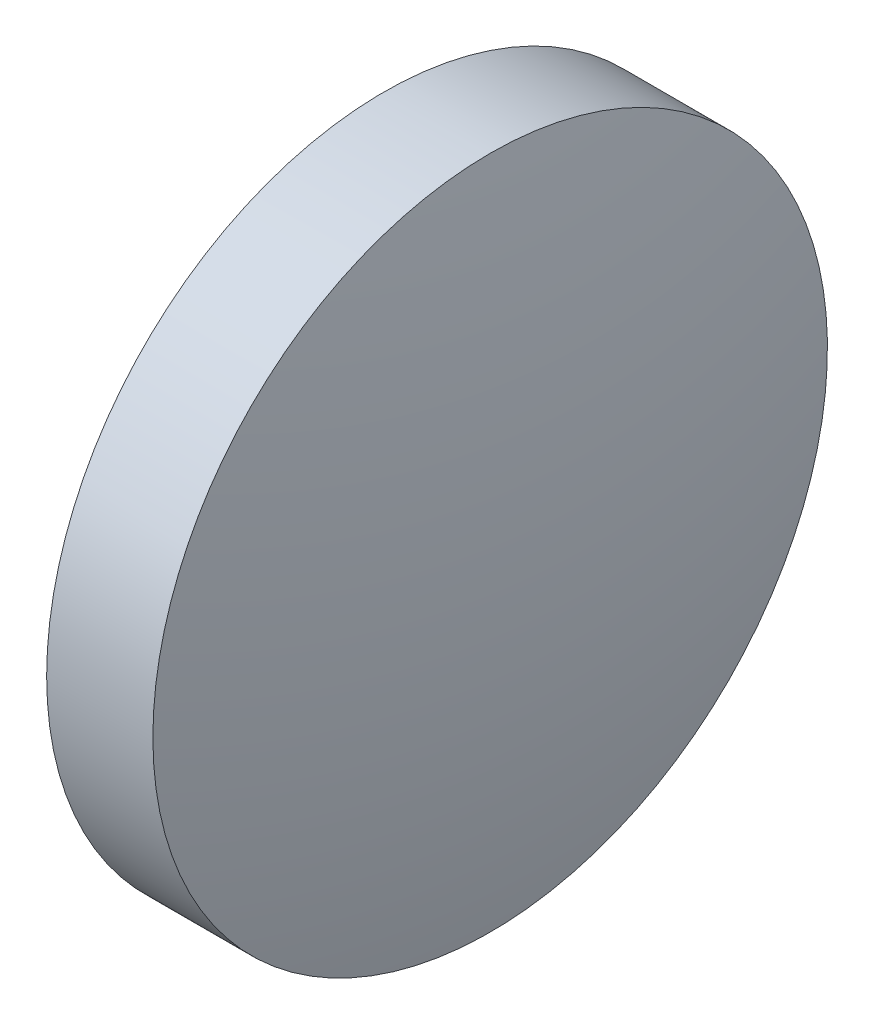
ISO-10303-21;
HEADER;
FILE_DESCRIPTION(('STEP AP214'),'2;1');
FILE_NAME('part.step','',(''),(''),'','','');
FILE_SCHEMA(('AUTOMOTIVE_DESIGN { 1 0 10303 214 1 1 1 1 }'));
ENDSEC;
DATA;
#1=APPLICATION_CONTEXT('core data for automotive mechanical design processes');
#2=APPLICATION_PROTOCOL_DEFINITION('international standard','automotive_design',2000,#1);
#3=PRODUCT_CONTEXT('',#1,'mechanical');
#4=PRODUCT('Part','Part','',(#3));
#5=PRODUCT_RELATED_PRODUCT_CATEGORY('part','',(#4));
#6=PRODUCT_DEFINITION_FORMATION('','',#4);
#7=PRODUCT_DEFINITION_CONTEXT('part definition',#1,'design');
#8=PRODUCT_DEFINITION('design','',#6,#7);
#9=PRODUCT_DEFINITION_SHAPE('','',#8);
#10=(LENGTH_UNIT() NAMED_UNIT(*) SI_UNIT(.MILLI.,.METRE.));
#11=(NAMED_UNIT(*) PLANE_ANGLE_UNIT() SI_UNIT($,.RADIAN.));
#12=(NAMED_UNIT(*) SI_UNIT($,.STERADIAN.) SOLID_ANGLE_UNIT());
#13=UNCERTAINTY_MEASURE_WITH_UNIT(LENGTH_MEASURE(1.E-05),#10,'distance_accuracy_value','');
#14=(GEOMETRIC_REPRESENTATION_CONTEXT(3) GLOBAL_UNCERTAINTY_ASSIGNED_CONTEXT((#13)) GLOBAL_UNIT_ASSIGNED_CONTEXT((#10,
#11,#12)) REPRESENTATION_CONTEXT('',''));
#15=CARTESIAN_POINT('',(0.,0.,0.));
#16=DIRECTION('',(0.,0.,1.));
#17=DIRECTION('',(1.,0.,0.));
#18=AXIS2_PLACEMENT_3D('',#15,#16,#17);
#19=CARTESIAN_POINT('',(431.943129011752,88.5342335831798,0.));
#20=DIRECTION('',(-1.,0.,0.));
#21=DIRECTION('',(0.,1.,0.));
#22=AXIS2_PLACEMENT_3D('',#19,#20,#21);
#23=SPHERICAL_SURFACE('',#22,29.1517857142857);
#24=CARTESIAN_POINT('',(460.394914726038,88.5342335831798,0.));
#25=DIRECTION('',(-1.,0.,0.));
#26=DIRECTION('',(0.,0.,1.));
#27=AXIS2_PLACEMENT_3D('',#24,#25,#26);
#28=CIRCLE('',#27,6.34999999999999);
#29=CARTESIAN_POINT('',(460.394914726038,88.5342335831798,6.34999999999999));
#30=VERTEX_POINT('',#29);
#31=EDGE_CURVE('E10',#30,#30,#28,.T.);
#32=ORIENTED_EDGE('',*,*,#31,.F.);
#33=EDGE_LOOP('',(#32));
#34=FACE_BOUND('',#33,.T.);
#35=ADVANCED_FACE('F35',(#34),#23,.T.);
#36=CARTESIAN_POINT('',(456.134383580183,88.5342335831798,0.));
#37=DIRECTION('',(-1.,0.,0.));
#38=DIRECTION('',(0.,0.,1.));
#39=AXIS2_PLACEMENT_3D('',#36,#37,#38);
#40=CYLINDRICAL_SURFACE('',#39,6.34999999999999);
#41=CARTESIAN_POINT('',(458.394914726038,88.5342335831798,0.));
#42=DIRECTION('',(-1.,0.,0.));
#43=DIRECTION('',(0.,0.,1.));
#44=AXIS2_PLACEMENT_3D('',#41,#42,#43);
#45=CIRCLE('',#44,6.34999999999999);
#46=CARTESIAN_POINT('',(458.394914726038,88.5342335831798,6.34999999999999));
#47=VERTEX_POINT('',#46);
#48=EDGE_CURVE('E41',#47,#47,#45,.T.);
#49=ORIENTED_EDGE('',*,*,#48,.F.);
#50=EDGE_LOOP('',(#49));
#51=FACE_BOUND('',#50,.T.);
#52=ORIENTED_EDGE('',*,*,#31,.T.);
#53=EDGE_LOOP('',(#52));
#54=FACE_BOUND('',#53,.T.);
#55=ADVANCED_FACE('F49',(#51,#54),#40,.T.);
#56=CARTESIAN_POINT('',(458.394914726038,88.5342335831798,0.));
#57=DIRECTION('',(1.,0.,0.));
#58=DIRECTION('',(0.,0.,-1.));
#59=AXIS2_PLACEMENT_3D('',#56,#57,#58);
#60=PLANE('',#59);
#61=ORIENTED_EDGE('',*,*,#48,.T.);
#62=EDGE_LOOP('',(#61));
#63=FACE_BOUND('',#62,.T.);
#64=ADVANCED_FACE('F47',(#63),#60,.F.);
#65=CLOSED_SHELL('',(#35,#55,#64));
#66=MANIFOLD_SOLID_BREP('B2',#65);
#67=ADVANCED_BREP_SHAPE_REPRESENTATION('',(#18,#66),#14);
#68=SHAPE_DEFINITION_REPRESENTATION(#9,#67);
ENDSEC;
END-ISO-10303-21;
